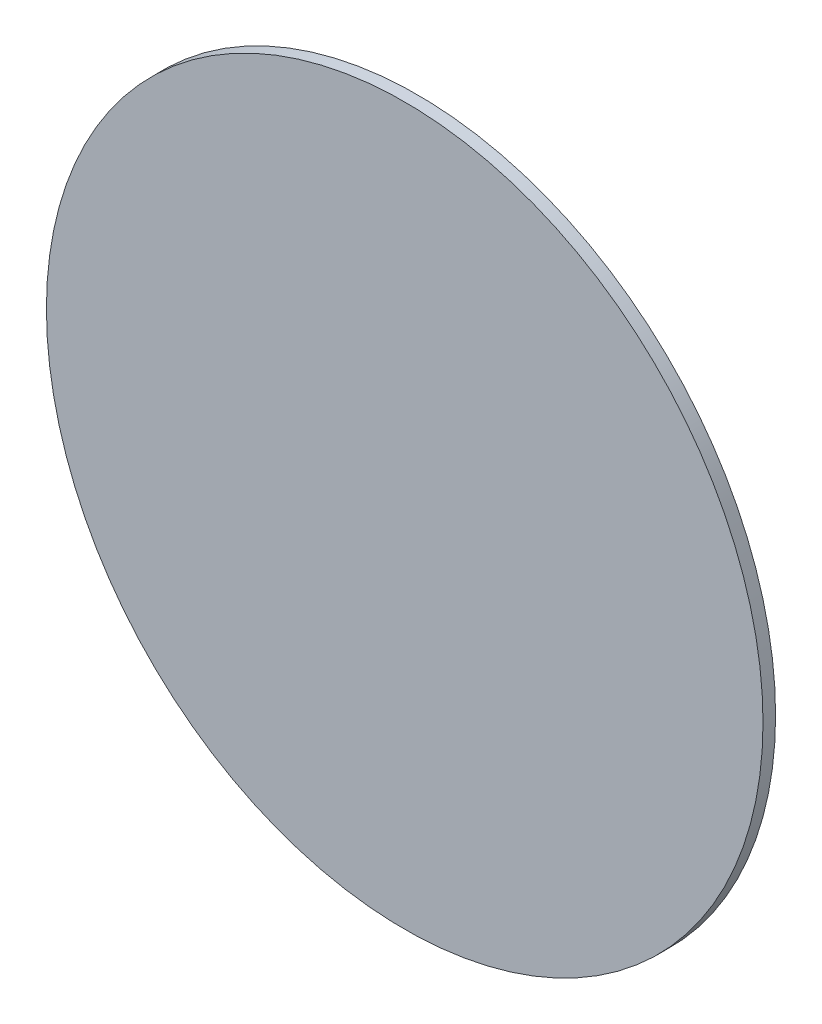
ISO-10303-21;
HEADER;
FILE_DESCRIPTION(('STEP AP214'),'2;1');
FILE_NAME('part.step','',(''),(''),'','','');
FILE_SCHEMA(('AUTOMOTIVE_DESIGN { 1 0 10303 214 1 1 1 1 }'));
ENDSEC;
DATA;
#1=APPLICATION_CONTEXT('core data for automotive mechanical design processes');
#2=APPLICATION_PROTOCOL_DEFINITION('international standard','automotive_design',2000,#1);
#3=PRODUCT_CONTEXT('',#1,'mechanical');
#4=PRODUCT('Part','Part','',(#3));
#5=PRODUCT_RELATED_PRODUCT_CATEGORY('part','',(#4));
#6=PRODUCT_DEFINITION_FORMATION('','',#4);
#7=PRODUCT_DEFINITION_CONTEXT('part definition',#1,'design');
#8=PRODUCT_DEFINITION('design','',#6,#7);
#9=PRODUCT_DEFINITION_SHAPE('','',#8);
#10=(LENGTH_UNIT() NAMED_UNIT(*) SI_UNIT(.MILLI.,.METRE.));
#11=(NAMED_UNIT(*) PLANE_ANGLE_UNIT() SI_UNIT($,.RADIAN.));
#12=(NAMED_UNIT(*) SI_UNIT($,.STERADIAN.) SOLID_ANGLE_UNIT());
#13=UNCERTAINTY_MEASURE_WITH_UNIT(LENGTH_MEASURE(1.E-05),#10,'distance_accuracy_value','');
#14=(GEOMETRIC_REPRESENTATION_CONTEXT(3) GLOBAL_UNCERTAINTY_ASSIGNED_CONTEXT((#13)) GLOBAL_UNIT_ASSIGNED_CONTEXT((#10,
#11,#12)) REPRESENTATION_CONTEXT('',''));
#15=CARTESIAN_POINT('',(0.,0.,0.));
#16=DIRECTION('',(0.,0.,1.));
#17=DIRECTION('',(1.,0.,0.));
#18=AXIS2_PLACEMENT_3D('',#15,#16,#17);
#19=CARTESIAN_POINT('',(0.,0.,1.));
#20=DIRECTION('',(0.,0.,-1.));
#21=DIRECTION('',(-1.,0.,0.));
#22=AXIS2_PLACEMENT_3D('',#19,#20,#21);
#23=CYLINDRICAL_SURFACE('',#22,28.5);
#24=CARTESIAN_POINT('',(0.,0.,1.));
#25=DIRECTION('',(0.,0.,1.));
#26=DIRECTION('',(1.,0.,0.));
#27=AXIS2_PLACEMENT_3D('',#24,#25,#26);
#28=CIRCLE('',#27,28.5);
#29=CARTESIAN_POINT('',(28.5,0.,1.));
#30=VERTEX_POINT('',#29);
#31=EDGE_CURVE('E10',#30,#30,#28,.T.);
#32=ORIENTED_EDGE('',*,*,#31,.F.);
#33=EDGE_LOOP('',(#32));
#34=FACE_BOUND('',#33,.T.);
#35=CARTESIAN_POINT('',(0.,0.,0.));
#36=DIRECTION('',(0.,0.,1.));
#37=DIRECTION('',(1.,0.,0.));
#38=AXIS2_PLACEMENT_3D('',#35,#36,#37);
#39=CIRCLE('',#38,28.5);
#40=CARTESIAN_POINT('',(28.5,0.,0.));
#41=VERTEX_POINT('',#40);
#42=EDGE_CURVE('E33',#41,#41,#39,.T.);
#43=ORIENTED_EDGE('',*,*,#42,.T.);
#44=EDGE_LOOP('',(#43));
#45=FACE_BOUND('',#44,.T.);
#46=ADVANCED_FACE('F30',(#34,#45),#23,.T.);
#47=CARTESIAN_POINT('',(0.,0.,1.));
#48=DIRECTION('',(0.,0.,1.));
#49=DIRECTION('',(1.,0.,0.));
#50=AXIS2_PLACEMENT_3D('',#47,#48,#49);
#51=PLANE('',#50);
#52=ORIENTED_EDGE('',*,*,#31,.T.);
#53=EDGE_LOOP('',(#52));
#54=FACE_BOUND('',#53,.T.);
#55=ADVANCED_FACE('F45',(#54),#51,.T.);
#56=CARTESIAN_POINT('',(0.,0.,0.));
#57=DIRECTION('',(0.,0.,1.));
#58=DIRECTION('',(1.,0.,0.));
#59=AXIS2_PLACEMENT_3D('',#56,#57,#58);
#60=PLANE('',#59);
#61=ORIENTED_EDGE('',*,*,#42,.F.);
#62=EDGE_LOOP('',(#61));
#63=FACE_BOUND('',#62,.T.);
#64=ADVANCED_FACE('F43',(#63),#60,.F.);
#65=CLOSED_SHELL('',(#46,#55,#64));
#66=MANIFOLD_SOLID_BREP('B2',#65);
#67=ADVANCED_BREP_SHAPE_REPRESENTATION('',(#18,#66),#14);
#68=SHAPE_DEFINITION_REPRESENTATION(#9,#67);
ENDSEC;
END-ISO-10303-21;
